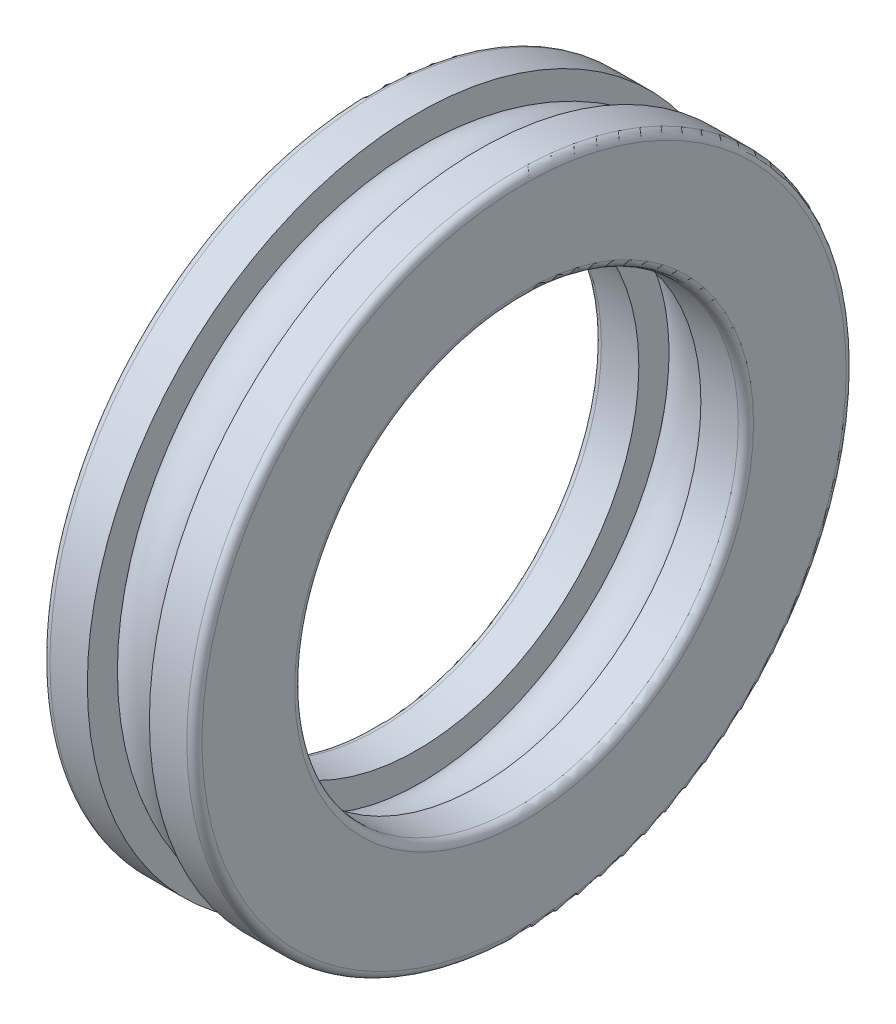
ISO-10303-21;
HEADER;
FILE_DESCRIPTION(('STEP AP214'),'2;1');
FILE_NAME('part.step','',(''),(''),'','','');
FILE_SCHEMA(('AUTOMOTIVE_DESIGN { 1 0 10303 214 1 1 1 1 }'));
ENDSEC;
DATA;
#1=APPLICATION_CONTEXT('core data for automotive mechanical design processes');
#2=APPLICATION_PROTOCOL_DEFINITION('international standard','automotive_design',2000,#1);
#3=PRODUCT_CONTEXT('',#1,'mechanical');
#4=PRODUCT('Part','Part','',(#3));
#5=PRODUCT_RELATED_PRODUCT_CATEGORY('part','',(#4));
#6=PRODUCT_DEFINITION_FORMATION('','',#4);
#7=PRODUCT_DEFINITION_CONTEXT('part definition',#1,'design');
#8=PRODUCT_DEFINITION('design','',#6,#7);
#9=PRODUCT_DEFINITION_SHAPE('','',#8);
#10=(LENGTH_UNIT() NAMED_UNIT(*) SI_UNIT(.MILLI.,.METRE.));
#11=(NAMED_UNIT(*) PLANE_ANGLE_UNIT() SI_UNIT($,.RADIAN.));
#12=(NAMED_UNIT(*) SI_UNIT($,.STERADIAN.) SOLID_ANGLE_UNIT());
#13=UNCERTAINTY_MEASURE_WITH_UNIT(LENGTH_MEASURE(1.E-05),#10,'distance_accuracy_value','');
#14=(GEOMETRIC_REPRESENTATION_CONTEXT(3) GLOBAL_UNCERTAINTY_ASSIGNED_CONTEXT((#13)) GLOBAL_UNIT_ASSIGNED_CONTEXT((#10,
#11,#12)) REPRESENTATION_CONTEXT('',''));
#15=CARTESIAN_POINT('',(0.,0.,0.));
#16=DIRECTION('',(0.,0.,1.));
#17=DIRECTION('',(1.,0.,0.));
#18=AXIS2_PLACEMENT_3D('',#15,#16,#17);
#19=CARTESIAN_POINT('',(0.,0.,0.));
#20=DIRECTION('',(-1.,0.,0.));
#21=DIRECTION('',(0.,0.,1.));
#22=AXIS2_PLACEMENT_3D('',#19,#20,#21);
#23=TOROIDAL_SURFACE('',#22,21.75,3.06);
#24=CARTESIAN_POINT('',(2.448,0.,0.));
#25=DIRECTION('',(-1.,0.,0.));
#26=DIRECTION('',(0.,0.,1.));
#27=AXIS2_PLACEMENT_3D('',#24,#25,#26);
#28=CIRCLE('',#27,23.586);
#29=CARTESIAN_POINT('',(2.448,0.,23.586));
#30=VERTEX_POINT('',#29);
#31=EDGE_CURVE('E35',#30,#30,#28,.T.);
#32=ORIENTED_EDGE('',*,*,#31,.T.);
#33=EDGE_LOOP('',(#32));
#34=FACE_BOUND('',#33,.T.);
#35=CARTESIAN_POINT('',(-2.448,0.,0.));
#36=DIRECTION('',(1.,0.,0.));
#37=DIRECTION('',(0.,0.,-1.));
#38=AXIS2_PLACEMENT_3D('',#35,#36,#37);
#39=CIRCLE('',#38,23.586);
#40=CARTESIAN_POINT('',(-2.448,0.,-23.586));
#41=VERTEX_POINT('',#40);
#42=EDGE_CURVE('E50',#41,#41,#39,.F.);
#43=ORIENTED_EDGE('',*,*,#42,.F.);
#44=EDGE_LOOP('',(#43));
#45=FACE_BOUND('',#44,.T.);
#46=ADVANCED_FACE('F31',(#34,#45),#23,.T.);
#47=CARTESIAN_POINT('',(-2.448,19.9559763100784,0.));
#48=DIRECTION('',(1.,0.,0.));
#49=DIRECTION('',(0.,0.,-1.));
#50=AXIS2_PLACEMENT_3D('',#47,#48,#49);
#51=PLANE('',#50);
#52=CARTESIAN_POINT('',(-2.44799999999999,0.,0.));
#53=DIRECTION('',(1.,0.,0.));
#54=DIRECTION('',(0.,0.,-1.));
#55=AXIS2_PLACEMENT_3D('',#52,#53,#54);
#56=CIRCLE('',#55,17.5);
#57=CARTESIAN_POINT('',(-2.44799999999999,0.,-17.5));
#58=VERTEX_POINT('',#57);
#59=EDGE_CURVE('E69',#58,#58,#56,.T.);
#60=ORIENTED_EDGE('',*,*,#59,.F.);
#61=EDGE_LOOP('',(#60));
#62=FACE_BOUND('',#61,.T.);
#63=CARTESIAN_POINT('',(-2.448,0.,0.));
#64=DIRECTION('',(-1.,0.,0.));
#65=DIRECTION('',(0.,0.,1.));
#66=AXIS2_PLACEMENT_3D('',#63,#64,#65);
#67=CIRCLE('',#66,19.914);
#68=CARTESIAN_POINT('',(-2.448,0.,19.914));
#69=VERTEX_POINT('',#68);
#70=EDGE_CURVE('E48',#69,#69,#67,.F.);
#71=ORIENTED_EDGE('',*,*,#70,.T.);
#72=EDGE_LOOP('',(#71));
#73=FACE_BOUND('',#72,.T.);
#74=ADVANCED_FACE('F98',(#62,#73),#51,.T.);
#75=CARTESIAN_POINT('',(-2.448,26.,0.));
#76=DIRECTION('',(1.,0.,0.));
#77=DIRECTION('',(0.,0.,-1.));
#78=AXIS2_PLACEMENT_3D('',#75,#76,#77);
#79=PLANE('',#78);
#80=ORIENTED_EDGE('',*,*,#42,.T.);
#81=EDGE_LOOP('',(#80));
#82=FACE_BOUND('',#81,.T.);
#83=CARTESIAN_POINT('',(-2.448,0.,0.));
#84=DIRECTION('',(1.,0.,0.));
#85=DIRECTION('',(0.,0.,-1.));
#86=AXIS2_PLACEMENT_3D('',#83,#84,#85);
#87=CIRCLE('',#86,26.);
#88=CARTESIAN_POINT('',(-2.448,0.,-26.));
#89=VERTEX_POINT('',#88);
#90=EDGE_CURVE('E10',#89,#89,#87,.T.);
#91=ORIENTED_EDGE('',*,*,#90,.T.);
#92=EDGE_LOOP('',(#91));
#93=FACE_BOUND('',#92,.T.);
#94=ADVANCED_FACE('F33',(#82,#93),#79,.T.);
#95=CARTESIAN_POINT('',(-34.925,0.,0.));
#96=DIRECTION('',(1.,0.,0.));
#97=DIRECTION('',(0.,0.,-1.));
#98=AXIS2_PLACEMENT_3D('',#95,#96,#97);
#99=CYLINDRICAL_SURFACE('',#98,26.);
#100=CARTESIAN_POINT('',(-5.4,0.,0.));
#101=DIRECTION('',(1.,0.,0.));
#102=DIRECTION('',(0.,0.,-1.));
#103=AXIS2_PLACEMENT_3D('',#100,#101,#102);
#104=CIRCLE('',#103,26.);
#105=CARTESIAN_POINT('',(-5.4,0.,-26.));
#106=VERTEX_POINT('',#105);
#107=EDGE_CURVE('E39',#106,#106,#104,.T.);
#108=ORIENTED_EDGE('',*,*,#107,.T.);
#109=EDGE_LOOP('',(#108));
#110=FACE_BOUND('',#109,.T.);
#111=ORIENTED_EDGE('',*,*,#90,.F.);
#112=EDGE_LOOP('',(#111));
#113=FACE_BOUND('',#112,.T.);
#114=ADVANCED_FACE('F95',(#110,#113),#99,.T.);
#115=CARTESIAN_POINT('',(-5.4,0.,0.));
#116=DIRECTION('',(1.,0.,0.));
#117=DIRECTION('',(0.,0.,-1.));
#118=AXIS2_PLACEMENT_3D('',#115,#116,#117);
#119=TOROIDAL_SURFACE('',#118,25.4,0.599999999999998);
#120=CARTESIAN_POINT('',(-6.,0.,0.));
#121=DIRECTION('',(1.,0.,0.));
#122=DIRECTION('',(0.,0.,-1.));
#123=AXIS2_PLACEMENT_3D('',#120,#121,#122);
#124=CIRCLE('',#123,25.4);
#125=CARTESIAN_POINT('',(-6.,0.,-25.4));
#126=VERTEX_POINT('',#125);
#127=EDGE_CURVE('E44',#126,#126,#124,.T.);
#128=ORIENTED_EDGE('',*,*,#127,.T.);
#129=EDGE_LOOP('',(#128));
#130=FACE_BOUND('',#129,.T.);
#131=ORIENTED_EDGE('',*,*,#107,.F.);
#132=EDGE_LOOP('',(#131));
#133=FACE_BOUND('',#132,.T.);
#134=ADVANCED_FACE('F80',(#130,#133),#119,.T.);
#135=CARTESIAN_POINT('',(-6.,18.1,0.));
#136=DIRECTION('',(-1.,0.,0.));
#137=DIRECTION('',(0.,0.,1.));
#138=AXIS2_PLACEMENT_3D('',#135,#136,#137);
#139=PLANE('',#138);
#140=CARTESIAN_POINT('',(-6.,0.,0.));
#141=DIRECTION('',(1.,0.,0.));
#142=DIRECTION('',(0.,0.,-1.));
#143=AXIS2_PLACEMENT_3D('',#140,#141,#142);
#144=CIRCLE('',#143,18.1);
#145=CARTESIAN_POINT('',(-6.,0.,-18.1));
#146=VERTEX_POINT('',#145);
#147=EDGE_CURVE('E75',#146,#146,#144,.T.);
#148=ORIENTED_EDGE('',*,*,#147,.T.);
#149=EDGE_LOOP('',(#148));
#150=FACE_BOUND('',#149,.T.);
#151=ORIENTED_EDGE('',*,*,#127,.F.);
#152=EDGE_LOOP('',(#151));
#153=FACE_BOUND('',#152,.T.);
#154=ADVANCED_FACE('F83',(#150,#153),#139,.T.);
#155=CARTESIAN_POINT('',(-5.4,0.,0.));
#156=DIRECTION('',(1.,0.,0.));
#157=DIRECTION('',(0.,0.,-1.));
#158=AXIS2_PLACEMENT_3D('',#155,#156,#157);
#159=TOROIDAL_SURFACE('',#158,18.1,0.6);
#160=CARTESIAN_POINT('',(-5.4,0.,0.));
#161=DIRECTION('',(1.,0.,0.));
#162=DIRECTION('',(0.,0.,-1.));
#163=AXIS2_PLACEMENT_3D('',#160,#161,#162);
#164=CIRCLE('',#163,17.5);
#165=CARTESIAN_POINT('',(-5.4,0.,-17.5));
#166=VERTEX_POINT('',#165);
#167=EDGE_CURVE('E72',#166,#166,#164,.T.);
#168=ORIENTED_EDGE('',*,*,#167,.T.);
#169=EDGE_LOOP('',(#168));
#170=FACE_BOUND('',#169,.T.);
#171=ORIENTED_EDGE('',*,*,#147,.F.);
#172=EDGE_LOOP('',(#171));
#173=FACE_BOUND('',#172,.T.);
#174=ADVANCED_FACE('F85',(#170,#173),#159,.T.);
#175=CARTESIAN_POINT('',(-34.925,0.,0.));
#176=DIRECTION('',(1.,0.,0.));
#177=DIRECTION('',(0.,0.,-1.));
#178=AXIS2_PLACEMENT_3D('',#175,#176,#177);
#179=CYLINDRICAL_SURFACE('',#178,17.5);
#180=ORIENTED_EDGE('',*,*,#59,.T.);
#181=EDGE_LOOP('',(#180));
#182=FACE_BOUND('',#181,.T.);
#183=ORIENTED_EDGE('',*,*,#167,.F.);
#184=EDGE_LOOP('',(#183));
#185=FACE_BOUND('',#184,.T.);
#186=ADVANCED_FACE('F92',(#182,#185),#179,.F.);
#187=CARTESIAN_POINT('',(2.448,0.,0.));
#188=DIRECTION('',(1.,0.,0.));
#189=DIRECTION('',(0.,0.,-1.));
#190=AXIS2_PLACEMENT_3D('',#187,#188,#189);
#191=CIRCLE('',#190,19.914);
#192=CARTESIAN_POINT('',(2.448,0.,-19.914));
#193=VERTEX_POINT('',#192);
#194=EDGE_CURVE('E51',#193,#193,#191,.T.);
#195=ORIENTED_EDGE('',*,*,#194,.T.);
#196=EDGE_LOOP('',(#195));
#197=FACE_BOUND('',#196,.T.);
#198=ORIENTED_EDGE('',*,*,#70,.F.);
#199=EDGE_LOOP('',(#198));
#200=FACE_BOUND('',#199,.T.);
#201=ADVANCED_FACE('F101',(#197,#200),#23,.T.);
#202=CARTESIAN_POINT('',(2.448,19.9559763100784,0.));
#203=DIRECTION('',(-1.,0.,0.));
#204=DIRECTION('',(0.,0.,-1.));
#205=AXIS2_PLACEMENT_3D('',#202,#203,#204);
#206=PLANE('',#205);
#207=CARTESIAN_POINT('',(2.44799999999999,0.,0.));
#208=DIRECTION('',(1.,0.,0.));
#209=DIRECTION('',(0.,0.,-1.));
#210=AXIS2_PLACEMENT_3D('',#207,#208,#209);
#211=CIRCLE('',#210,17.5);
#212=CARTESIAN_POINT('',(2.44799999999999,0.,-17.5));
#213=VERTEX_POINT('',#212);
#214=EDGE_CURVE('E245',#213,#213,#211,.T.);
#215=ORIENTED_EDGE('',*,*,#214,.T.);
#216=EDGE_LOOP('',(#215));
#217=FACE_BOUND('',#216,.T.);
#218=ORIENTED_EDGE('',*,*,#194,.F.);
#219=EDGE_LOOP('',(#218));
#220=FACE_BOUND('',#219,.T.);
#221=ADVANCED_FACE('F110',(#217,#220),#206,.T.);
#222=CARTESIAN_POINT('',(2.448,26.,0.));
#223=DIRECTION('',(-1.,0.,0.));
#224=DIRECTION('',(0.,0.,-1.));
#225=AXIS2_PLACEMENT_3D('',#222,#223,#224);
#226=PLANE('',#225);
#227=ORIENTED_EDGE('',*,*,#31,.F.);
#228=EDGE_LOOP('',(#227));
#229=FACE_BOUND('',#228,.T.);
#230=CARTESIAN_POINT('',(2.448,0.,0.));
#231=DIRECTION('',(1.,0.,0.));
#232=DIRECTION('',(0.,0.,-1.));
#233=AXIS2_PLACEMENT_3D('',#230,#231,#232);
#234=CIRCLE('',#233,26.);
#235=CARTESIAN_POINT('',(2.448,0.,-26.));
#236=VERTEX_POINT('',#235);
#237=EDGE_CURVE('E53',#236,#236,#234,.T.);
#238=ORIENTED_EDGE('',*,*,#237,.F.);
#239=EDGE_LOOP('',(#238));
#240=FACE_BOUND('',#239,.T.);
#241=ADVANCED_FACE('F115',(#229,#240),#226,.T.);
#242=CARTESIAN_POINT('',(34.925,0.,0.));
#243=DIRECTION('',(-1.,0.,0.));
#244=DIRECTION('',(0.,0.,-1.));
#245=AXIS2_PLACEMENT_3D('',#242,#243,#244);
#246=CYLINDRICAL_SURFACE('',#245,26.);
#247=CARTESIAN_POINT('',(5.4,0.,0.));
#248=DIRECTION('',(1.,0.,0.));
#249=DIRECTION('',(0.,0.,-1.));
#250=AXIS2_PLACEMENT_3D('',#247,#248,#249);
#251=CIRCLE('',#250,26.);
#252=CARTESIAN_POINT('',(5.4,0.,-26.));
#253=VERTEX_POINT('',#252);
#254=EDGE_CURVE('E58',#253,#253,#251,.T.);
#255=ORIENTED_EDGE('',*,*,#254,.F.);
#256=EDGE_LOOP('',(#255));
#257=FACE_BOUND('',#256,.T.);
#258=ORIENTED_EDGE('',*,*,#237,.T.);
#259=EDGE_LOOP('',(#258));
#260=FACE_BOUND('',#259,.T.);
#261=ADVANCED_FACE('F189',(#257,#260),#246,.T.);
#262=CARTESIAN_POINT('',(5.4,0.,0.));
#263=DIRECTION('',(-1.,0.,0.));
#264=DIRECTION('',(0.,0.,-1.));
#265=AXIS2_PLACEMENT_3D('',#262,#263,#264);
#266=TOROIDAL_SURFACE('',#265,25.4,0.599999999999998);
#267=CARTESIAN_POINT('',(6.,0.,0.));
#268=DIRECTION('',(1.,0.,0.));
#269=DIRECTION('',(0.,0.,-1.));
#270=AXIS2_PLACEMENT_3D('',#267,#268,#269);
#271=CIRCLE('',#270,25.4);
#272=CARTESIAN_POINT('',(6.,0.,-25.4));
#273=VERTEX_POINT('',#272);
#274=EDGE_CURVE('E63',#273,#273,#271,.T.);
#275=ORIENTED_EDGE('',*,*,#274,.F.);
#276=EDGE_LOOP('',(#275));
#277=FACE_BOUND('',#276,.T.);
#278=ORIENTED_EDGE('',*,*,#254,.T.);
#279=EDGE_LOOP('',(#278));
#280=FACE_BOUND('',#279,.T.);
#281=ADVANCED_FACE('F197',(#277,#280),#266,.T.);
#282=CARTESIAN_POINT('',(6.,18.1,0.));
#283=DIRECTION('',(1.,0.,0.));
#284=DIRECTION('',(0.,0.,1.));
#285=AXIS2_PLACEMENT_3D('',#282,#283,#284);
#286=PLANE('',#285);
#287=CARTESIAN_POINT('',(6.,0.,0.));
#288=DIRECTION('',(1.,0.,0.));
#289=DIRECTION('',(0.,0.,-1.));
#290=AXIS2_PLACEMENT_3D('',#287,#288,#289);
#291=CIRCLE('',#290,18.1);
#292=CARTESIAN_POINT('',(6.,0.,-18.1));
#293=VERTEX_POINT('',#292);
#294=EDGE_CURVE('E249',#293,#293,#291,.T.);
#295=ORIENTED_EDGE('',*,*,#294,.F.);
#296=EDGE_LOOP('',(#295));
#297=FACE_BOUND('',#296,.T.);
#298=ORIENTED_EDGE('',*,*,#274,.T.);
#299=EDGE_LOOP('',(#298));
#300=FACE_BOUND('',#299,.T.);
#301=ADVANCED_FACE('F206',(#297,#300),#286,.T.);
#302=CARTESIAN_POINT('',(5.4,0.,0.));
#303=DIRECTION('',(-1.,0.,0.));
#304=DIRECTION('',(0.,0.,-1.));
#305=AXIS2_PLACEMENT_3D('',#302,#303,#304);
#306=TOROIDAL_SURFACE('',#305,18.1,0.6);
#307=CARTESIAN_POINT('',(5.4,0.,0.));
#308=DIRECTION('',(1.,0.,0.));
#309=DIRECTION('',(0.,0.,-1.));
#310=AXIS2_PLACEMENT_3D('',#307,#308,#309);
#311=CIRCLE('',#310,17.5);
#312=CARTESIAN_POINT('',(5.4,0.,-17.5));
#313=VERTEX_POINT('',#312);
#314=EDGE_CURVE('E248',#313,#313,#311,.T.);
#315=ORIENTED_EDGE('',*,*,#314,.F.);
#316=EDGE_LOOP('',(#315));
#317=FACE_BOUND('',#316,.T.);
#318=ORIENTED_EDGE('',*,*,#294,.T.);
#319=EDGE_LOOP('',(#318));
#320=FACE_BOUND('',#319,.T.);
#321=ADVANCED_FACE('F215',(#317,#320),#306,.T.);
#322=CARTESIAN_POINT('',(34.925,0.,0.));
#323=DIRECTION('',(-1.,0.,0.));
#324=DIRECTION('',(0.,0.,-1.));
#325=AXIS2_PLACEMENT_3D('',#322,#323,#324);
#326=CYLINDRICAL_SURFACE('',#325,17.5);
#327=ORIENTED_EDGE('',*,*,#214,.F.);
#328=EDGE_LOOP('',(#327));
#329=FACE_BOUND('',#328,.T.);
#330=ORIENTED_EDGE('',*,*,#314,.T.);
#331=EDGE_LOOP('',(#330));
#332=FACE_BOUND('',#331,.T.);
#333=ADVANCED_FACE('F224',(#329,#332),#326,.F.);
#334=CLOSED_SHELL('',(#46,#74,#94,#114,#134,#154,#174,#186,#201,#221,#241,#261,#281,#301,#321,#333));
#335=MANIFOLD_SOLID_BREP('B2',#334);
#336=ADVANCED_BREP_SHAPE_REPRESENTATION('',(#18,#335),#14);
#337=SHAPE_DEFINITION_REPRESENTATION(#9,#336);
ENDSEC;
END-ISO-10303-21;
